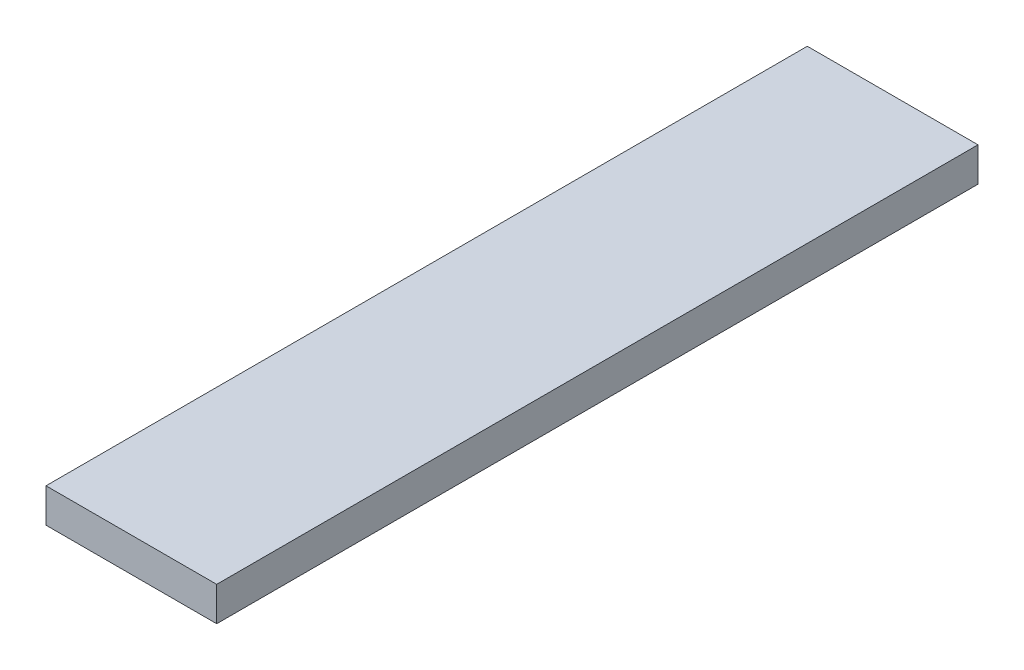
ISO-10303-21;
HEADER;
FILE_DESCRIPTION(('STEP AP214'),'2;1');
FILE_NAME('part.step','',(''),(''),'','','');
FILE_SCHEMA(('AUTOMOTIVE_DESIGN { 1 0 10303 214 1 1 1 1 }'));
ENDSEC;
DATA;
#1=APPLICATION_CONTEXT('core data for automotive mechanical design processes');
#2=APPLICATION_PROTOCOL_DEFINITION('international standard','automotive_design',2000,#1);
#3=PRODUCT_CONTEXT('',#1,'mechanical');
#4=PRODUCT('Part','Part','',(#3));
#5=PRODUCT_RELATED_PRODUCT_CATEGORY('part','',(#4));
#6=PRODUCT_DEFINITION_FORMATION('','',#4);
#7=PRODUCT_DEFINITION_CONTEXT('part definition',#1,'design');
#8=PRODUCT_DEFINITION('design','',#6,#7);
#9=PRODUCT_DEFINITION_SHAPE('','',#8);
#10=(LENGTH_UNIT() NAMED_UNIT(*) SI_UNIT(.MILLI.,.METRE.));
#11=(NAMED_UNIT(*) PLANE_ANGLE_UNIT() SI_UNIT($,.RADIAN.));
#12=(NAMED_UNIT(*) SI_UNIT($,.STERADIAN.) SOLID_ANGLE_UNIT());
#13=UNCERTAINTY_MEASURE_WITH_UNIT(LENGTH_MEASURE(1.E-05),#10,'distance_accuracy_value','');
#14=(GEOMETRIC_REPRESENTATION_CONTEXT(3) GLOBAL_UNCERTAINTY_ASSIGNED_CONTEXT((#13)) GLOBAL_UNIT_ASSIGNED_CONTEXT((#10,
#11,#12)) REPRESENTATION_CONTEXT('',''));
#15=CARTESIAN_POINT('',(0.,0.,0.));
#16=DIRECTION('',(0.,0.,1.));
#17=DIRECTION('',(1.,0.,0.));
#18=AXIS2_PLACEMENT_3D('',#15,#16,#17);
#19=CARTESIAN_POINT('',(0.,10.,3.88578058618805E-13));
#20=DIRECTION('',(0.,1.00000000000001,0.));
#21=DIRECTION('',(0.,0.,1.00000000000001));
#22=AXIS2_PLACEMENT_3D('',#19,#20,#21);
#23=PLANE('',#22);
#24=DIRECTION('',(-1.,0.,0.));
#25=VECTOR('',#24,1.);
#26=CARTESIAN_POINT('',(25.,10.,-111.5));
#27=LINE('',#26,#25);
#28=CARTESIAN_POINT('',(-25.,10.,-111.5));
#29=VERTEX_POINT('',#28);
#30=CARTESIAN_POINT('',(25.,10.,-111.5));
#31=VERTEX_POINT('',#30);
#32=EDGE_CURVE('E67',#29,#31,#27,.F.);
#33=ORIENTED_EDGE('',*,*,#32,.F.);
#34=DIRECTION('',(0.,0.,1.00000000000001));
#35=VECTOR('',#34,1.);
#36=CARTESIAN_POINT('',(-25.,10.,-111.5));
#37=LINE('',#36,#35);
#38=CARTESIAN_POINT('',(-25.,9.99999999999968,111.5));
#39=VERTEX_POINT('',#38);
#40=EDGE_CURVE('E19',#39,#29,#37,.F.);
#41=ORIENTED_EDGE('',*,*,#40,.F.);
#42=DIRECTION('',(1.,0.,0.));
#43=VECTOR('',#42,1.);
#44=CARTESIAN_POINT('',(-25.,9.99999999999968,111.5));
#45=LINE('',#44,#43);
#46=CARTESIAN_POINT('',(25.,9.99999999999968,111.5));
#47=VERTEX_POINT('',#46);
#48=EDGE_CURVE('E57',#47,#39,#45,.F.);
#49=ORIENTED_EDGE('',*,*,#48,.F.);
#50=DIRECTION('',(0.,0.,-1.00000000000001));
#51=VECTOR('',#50,1.);
#52=CARTESIAN_POINT('',(25.,9.99999999999968,111.5));
#53=LINE('',#52,#51);
#54=EDGE_CURVE('E52',#31,#47,#53,.F.);
#55=ORIENTED_EDGE('',*,*,#54,.F.);
#56=EDGE_LOOP('',(#33,#41,#49,#55));
#57=FACE_BOUND('',#56,.T.);
#58=ADVANCED_FACE('F16',(#57),#23,.T.);
#59=CARTESIAN_POINT('',(-25.,0.,-111.5));
#60=DIRECTION('',(-1.,0.,0.));
#61=DIRECTION('',(0.,0.,1.00000000000001));
#62=AXIS2_PLACEMENT_3D('',#59,#60,#61);
#63=PLANE('',#62);
#64=DIRECTION('',(0.,1.00000000000001,0.));
#65=VECTOR('',#64,1.);
#66=CARTESIAN_POINT('',(-25.,0.,-111.5));
#67=LINE('',#66,#65);
#68=CARTESIAN_POINT('',(-25.,0.,-111.5));
#69=VERTEX_POINT('',#68);
#70=EDGE_CURVE('E78',#69,#29,#67,.T.);
#71=ORIENTED_EDGE('',*,*,#70,.F.);
#72=DIRECTION('',(0.,0.,1.00000000000001));
#73=VECTOR('',#72,1.);
#74=CARTESIAN_POINT('',(-25.,0.,0.));
#75=LINE('',#74,#73);
#76=CARTESIAN_POINT('',(-25.,2.22044604925031E-13,111.500000000001));
#77=VERTEX_POINT('',#76);
#78=EDGE_CURVE('E73',#69,#77,#75,.T.);
#79=ORIENTED_EDGE('',*,*,#78,.T.);
#80=DIRECTION('',(0.,1.00000000000001,0.));
#81=VECTOR('',#80,1.);
#82=CARTESIAN_POINT('',(-25.,2.22044604925031E-13,111.500000000001));
#83=LINE('',#82,#81);
#84=EDGE_CURVE('E62',#39,#77,#83,.F.);
#85=ORIENTED_EDGE('',*,*,#84,.F.);
#86=ORIENTED_EDGE('',*,*,#40,.T.);
#87=EDGE_LOOP('',(#71,#79,#85,#86));
#88=FACE_BOUND('',#87,.T.);
#89=ADVANCED_FACE('F72',(#88),#63,.T.);
#90=CARTESIAN_POINT('',(-25.,2.22044604925031E-13,111.500000000001));
#91=DIRECTION('',(0.,0.,1.00000000000001));
#92=DIRECTION('',(1.,0.,0.));
#93=AXIS2_PLACEMENT_3D('',#90,#91,#92);
#94=PLANE('',#93);
#95=ORIENTED_EDGE('',*,*,#84,.T.);
#96=DIRECTION('',(1.,0.,0.));
#97=VECTOR('',#96,1.);
#98=CARTESIAN_POINT('',(0.,2.22044604925031E-13,111.500000000001));
#99=LINE('',#98,#97);
#100=CARTESIAN_POINT('',(25.,2.22044604925031E-13,111.500000000001));
#101=VERTEX_POINT('',#100);
#102=EDGE_CURVE('E83',#77,#101,#99,.T.);
#103=ORIENTED_EDGE('',*,*,#102,.T.);
#104=DIRECTION('',(0.,1.00000000000001,0.));
#105=VECTOR('',#104,1.);
#106=CARTESIAN_POINT('',(25.,2.22044604925031E-13,111.500000000001));
#107=LINE('',#106,#105);
#108=EDGE_CURVE('E64',#47,#101,#107,.F.);
#109=ORIENTED_EDGE('',*,*,#108,.F.);
#110=ORIENTED_EDGE('',*,*,#48,.T.);
#111=EDGE_LOOP('',(#95,#103,#109,#110));
#112=FACE_BOUND('',#111,.T.);
#113=ADVANCED_FACE('F59',(#112),#94,.T.);
#114=CARTESIAN_POINT('',(25.,2.22044604925031E-13,111.500000000001));
#115=DIRECTION('',(1.,0.,0.));
#116=DIRECTION('',(0.,0.,-1.00000000000001));
#117=AXIS2_PLACEMENT_3D('',#114,#115,#116);
#118=PLANE('',#117);
#119=ORIENTED_EDGE('',*,*,#108,.T.);
#120=DIRECTION('',(0.,0.,1.00000000000001));
#121=VECTOR('',#120,1.);
#122=CARTESIAN_POINT('',(25.,0.,0.));
#123=LINE('',#122,#121);
#124=CARTESIAN_POINT('',(25.,0.,-111.5));
#125=VERTEX_POINT('',#124);
#126=EDGE_CURVE('E25',#101,#125,#123,.F.);
#127=ORIENTED_EDGE('',*,*,#126,.T.);
#128=DIRECTION('',(0.,1.00000000000001,0.));
#129=VECTOR('',#128,1.);
#130=CARTESIAN_POINT('',(25.,0.,-111.5));
#131=LINE('',#130,#129);
#132=EDGE_CURVE('E33',#31,#125,#131,.F.);
#133=ORIENTED_EDGE('',*,*,#132,.F.);
#134=ORIENTED_EDGE('',*,*,#54,.T.);
#135=EDGE_LOOP('',(#119,#127,#133,#134));
#136=FACE_BOUND('',#135,.T.);
#137=ADVANCED_FACE('F87',(#136),#118,.T.);
#138=CARTESIAN_POINT('',(25.,0.,-111.5));
#139=DIRECTION('',(0.,0.,-1.00000000000001));
#140=DIRECTION('',(-1.,0.,0.));
#141=AXIS2_PLACEMENT_3D('',#138,#139,#140);
#142=PLANE('',#141);
#143=ORIENTED_EDGE('',*,*,#132,.T.);
#144=DIRECTION('',(1.,0.,0.));
#145=VECTOR('',#144,1.);
#146=CARTESIAN_POINT('',(2.63677968348475E-13,0.,-111.5));
#147=LINE('',#146,#145);
#148=EDGE_CURVE('E11',#125,#69,#147,.F.);
#149=ORIENTED_EDGE('',*,*,#148,.T.);
#150=ORIENTED_EDGE('',*,*,#70,.T.);
#151=ORIENTED_EDGE('',*,*,#32,.T.);
#152=EDGE_LOOP('',(#143,#149,#150,#151));
#153=FACE_BOUND('',#152,.T.);
#154=ADVANCED_FACE('F90',(#153),#142,.T.);
#155=CARTESIAN_POINT('',(0.,0.,0.));
#156=DIRECTION('',(0.,1.00000000000001,0.));
#157=DIRECTION('',(0.,0.,1.00000000000001));
#158=AXIS2_PLACEMENT_3D('',#155,#156,#157);
#159=PLANE('',#158);
#160=ORIENTED_EDGE('',*,*,#126,.F.);
#161=ORIENTED_EDGE('',*,*,#102,.F.);
#162=ORIENTED_EDGE('',*,*,#78,.F.);
#163=ORIENTED_EDGE('',*,*,#148,.F.);
#164=EDGE_LOOP('',(#160,#161,#162,#163));
#165=FACE_BOUND('',#164,.T.);
#166=ADVANCED_FACE('F89',(#165),#159,.F.);
#167=CLOSED_SHELL('',(#58,#89,#113,#137,#154,#166));
#168=MANIFOLD_SOLID_BREP('B1',#167);
#169=ADVANCED_BREP_SHAPE_REPRESENTATION('',(#18,#168),#14);
#170=SHAPE_DEFINITION_REPRESENTATION(#9,#169);
ENDSEC;
END-ISO-10303-21;
